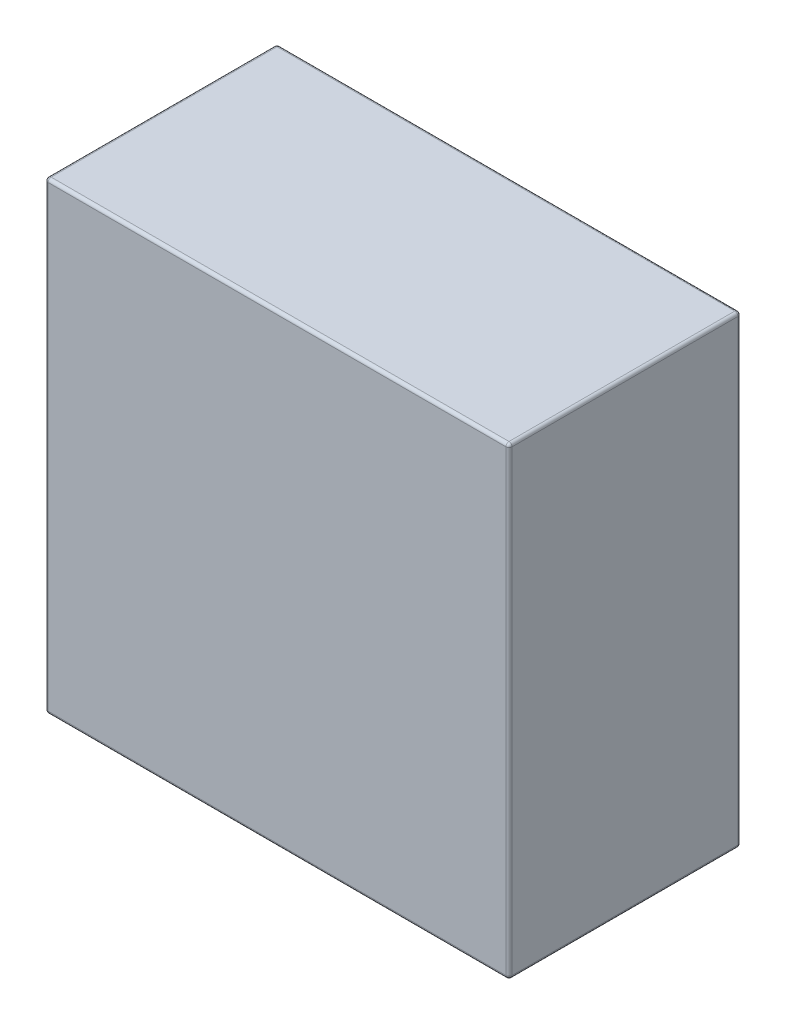
ISO-10303-21;
HEADER;
FILE_DESCRIPTION(('STEP AP214'),'2;1');
FILE_NAME('part.step','',(''),(''),'','','');
FILE_SCHEMA(('AUTOMOTIVE_DESIGN { 1 0 10303 214 1 1 1 1 }'));
ENDSEC;
DATA;
#1=APPLICATION_CONTEXT('core data for automotive mechanical design processes');
#2=APPLICATION_PROTOCOL_DEFINITION('international standard','automotive_design',2000,#1);
#3=PRODUCT_CONTEXT('',#1,'mechanical');
#4=PRODUCT('Part','Part','',(#3));
#5=PRODUCT_RELATED_PRODUCT_CATEGORY('part','',(#4));
#6=PRODUCT_DEFINITION_FORMATION('','',#4);
#7=PRODUCT_DEFINITION_CONTEXT('part definition',#1,'design');
#8=PRODUCT_DEFINITION('design','',#6,#7);
#9=PRODUCT_DEFINITION_SHAPE('','',#8);
#10=(LENGTH_UNIT() NAMED_UNIT(*) SI_UNIT(.MILLI.,.METRE.));
#11=(NAMED_UNIT(*) PLANE_ANGLE_UNIT() SI_UNIT($,.RADIAN.));
#12=(NAMED_UNIT(*) SI_UNIT($,.STERADIAN.) SOLID_ANGLE_UNIT());
#13=UNCERTAINTY_MEASURE_WITH_UNIT(LENGTH_MEASURE(1.E-05),#10,'distance_accuracy_value','');
#14=(GEOMETRIC_REPRESENTATION_CONTEXT(3) GLOBAL_UNCERTAINTY_ASSIGNED_CONTEXT((#13)) GLOBAL_UNIT_ASSIGNED_CONTEXT((#10,
#11,#12)) REPRESENTATION_CONTEXT('',''));
#15=CARTESIAN_POINT('',(0.,0.,0.));
#16=DIRECTION('',(0.,0.,1.));
#17=DIRECTION('',(1.,0.,0.));
#18=AXIS2_PLACEMENT_3D('',#15,#16,#17);
#19=CARTESIAN_POINT('',(0.,0.,150.));
#20=DIRECTION('',(1.,0.,0.));
#21=DIRECTION('',(0.,0.,-1.));
#22=AXIS2_PLACEMENT_3D('',#19,#20,#21);
#23=PLANE('',#22);
#24=DIRECTION('',(0.,0.,-1.));
#25=VECTOR('',#24,1.);
#26=CARTESIAN_POINT('',(0.,298.,150.));
#27=LINE('',#26,#25);
#28=CARTESIAN_POINT('',(0.,298.,148.));
#29=VERTEX_POINT('',#28);
#30=CARTESIAN_POINT('',(0.,298.,2.));
#31=VERTEX_POINT('',#30);
#32=EDGE_CURVE('E125',#29,#31,#27,.T.);
#33=ORIENTED_EDGE('',*,*,#32,.T.);
#34=DIRECTION('',(0.,-1.,0.));
#35=VECTOR('',#34,1.);
#36=CARTESIAN_POINT('',(0.,0.,2.));
#37=LINE('',#36,#35);
#38=CARTESIAN_POINT('',(0.,2.,2.));
#39=VERTEX_POINT('',#38);
#40=EDGE_CURVE('E159',#31,#39,#37,.T.);
#41=ORIENTED_EDGE('',*,*,#40,.T.);
#42=DIRECTION('',(0.,0.,-1.));
#43=VECTOR('',#42,1.);
#44=CARTESIAN_POINT('',(0.,2.,150.));
#45=LINE('',#44,#43);
#46=CARTESIAN_POINT('',(0.,2.,148.));
#47=VERTEX_POINT('',#46);
#48=EDGE_CURVE('E128',#39,#47,#45,.F.);
#49=ORIENTED_EDGE('',*,*,#48,.T.);
#50=DIRECTION('',(0.,-1.,0.));
#51=VECTOR('',#50,1.);
#52=CARTESIAN_POINT('',(0.,0.,148.));
#53=LINE('',#52,#51);
#54=EDGE_CURVE('E121',#47,#29,#53,.F.);
#55=ORIENTED_EDGE('',*,*,#54,.T.);
#56=EDGE_LOOP('',(#33,#41,#49,#55));
#57=FACE_BOUND('',#56,.T.);
#58=ADVANCED_FACE('F34',(#57),#23,.F.);
#59=CARTESIAN_POINT('',(0.,0.,150.));
#60=DIRECTION('',(0.,1.,0.));
#61=DIRECTION('',(0.,0.,1.));
#62=AXIS2_PLACEMENT_3D('',#59,#60,#61);
#63=PLANE('',#62);
#64=DIRECTION('',(0.,0.,-1.));
#65=VECTOR('',#64,1.);
#66=CARTESIAN_POINT('',(2.,0.,150.));
#67=LINE('',#66,#65);
#68=CARTESIAN_POINT('',(2.,0.,148.));
#69=VERTEX_POINT('',#68);
#70=CARTESIAN_POINT('',(2.,0.,2.));
#71=VERTEX_POINT('',#70);
#72=EDGE_CURVE('E190',#69,#71,#67,.T.);
#73=ORIENTED_EDGE('',*,*,#72,.T.);
#74=DIRECTION('',(1.,0.,0.));
#75=VECTOR('',#74,1.);
#76=CARTESIAN_POINT('',(300.,0.,2.));
#77=LINE('',#76,#75);
#78=CARTESIAN_POINT('',(298.,0.,2.));
#79=VERTEX_POINT('',#78);
#80=EDGE_CURVE('E194',#71,#79,#77,.T.);
#81=ORIENTED_EDGE('',*,*,#80,.T.);
#82=DIRECTION('',(0.,0.,-1.));
#83=VECTOR('',#82,1.);
#84=CARTESIAN_POINT('',(298.,0.,150.));
#85=LINE('',#84,#83);
#86=CARTESIAN_POINT('',(298.,0.,148.));
#87=VERTEX_POINT('',#86);
#88=EDGE_CURVE('E192',#79,#87,#85,.F.);
#89=ORIENTED_EDGE('',*,*,#88,.T.);
#90=DIRECTION('',(1.,0.,0.));
#91=VECTOR('',#90,1.);
#92=CARTESIAN_POINT('',(0.,0.,148.));
#93=LINE('',#92,#91);
#94=EDGE_CURVE('E188',#87,#69,#93,.F.);
#95=ORIENTED_EDGE('',*,*,#94,.T.);
#96=EDGE_LOOP('',(#73,#81,#89,#95));
#97=FACE_BOUND('',#96,.T.);
#98=ADVANCED_FACE('F263',(#97),#63,.F.);
#99=CARTESIAN_POINT('',(300.,0.,150.));
#100=DIRECTION('',(-1.,0.,0.));
#101=DIRECTION('',(0.,0.,1.));
#102=AXIS2_PLACEMENT_3D('',#99,#100,#101);
#103=PLANE('',#102);
#104=DIRECTION('',(0.,1.,0.));
#105=VECTOR('',#104,1.);
#106=CARTESIAN_POINT('',(300.,300.,2.));
#107=LINE('',#106,#105);
#108=CARTESIAN_POINT('',(300.,2.,2.));
#109=VERTEX_POINT('',#108);
#110=CARTESIAN_POINT('',(300.,298.,2.));
#111=VERTEX_POINT('',#110);
#112=EDGE_CURVE('E183',#109,#111,#107,.T.);
#113=ORIENTED_EDGE('',*,*,#112,.T.);
#114=DIRECTION('',(0.,0.,-1.));
#115=VECTOR('',#114,1.);
#116=CARTESIAN_POINT('',(300.,298.,150.));
#117=LINE('',#116,#115);
#118=CARTESIAN_POINT('',(300.,298.,148.));
#119=VERTEX_POINT('',#118);
#120=EDGE_CURVE('E185',#111,#119,#117,.F.);
#121=ORIENTED_EDGE('',*,*,#120,.T.);
#122=DIRECTION('',(0.,1.,0.));
#123=VECTOR('',#122,1.);
#124=CARTESIAN_POINT('',(300.,0.,148.));
#125=LINE('',#124,#123);
#126=CARTESIAN_POINT('',(300.,2.,148.));
#127=VERTEX_POINT('',#126);
#128=EDGE_CURVE('E179',#119,#127,#125,.F.);
#129=ORIENTED_EDGE('',*,*,#128,.T.);
#130=DIRECTION('',(0.,0.,-1.));
#131=VECTOR('',#130,1.);
#132=CARTESIAN_POINT('',(300.,2.,150.));
#133=LINE('',#132,#131);
#134=EDGE_CURVE('E181',#127,#109,#133,.T.);
#135=ORIENTED_EDGE('',*,*,#134,.T.);
#136=EDGE_LOOP('',(#113,#121,#129,#135));
#137=FACE_BOUND('',#136,.T.);
#138=ADVANCED_FACE('F272',(#137),#103,.F.);
#139=CARTESIAN_POINT('',(0.,300.,150.));
#140=DIRECTION('',(0.,-1.,0.));
#141=DIRECTION('',(0.,0.,-1.));
#142=AXIS2_PLACEMENT_3D('',#139,#140,#141);
#143=PLANE('',#142);
#144=DIRECTION('',(0.,0.,-1.));
#145=VECTOR('',#144,1.);
#146=CARTESIAN_POINT('',(298.,300.,150.));
#147=LINE('',#146,#145);
#148=CARTESIAN_POINT('',(298.,300.,148.));
#149=VERTEX_POINT('',#148);
#150=CARTESIAN_POINT('',(298.,300.,2.));
#151=VERTEX_POINT('',#150);
#152=EDGE_CURVE('E174',#149,#151,#147,.T.);
#153=ORIENTED_EDGE('',*,*,#152,.T.);
#154=DIRECTION('',(-1.,0.,0.));
#155=VECTOR('',#154,1.);
#156=CARTESIAN_POINT('',(0.,300.,2.));
#157=LINE('',#156,#155);
#158=CARTESIAN_POINT('',(2.,300.,2.));
#159=VERTEX_POINT('',#158);
#160=EDGE_CURVE('E176',#151,#159,#157,.T.);
#161=ORIENTED_EDGE('',*,*,#160,.T.);
#162=DIRECTION('',(0.,0.,-1.));
#163=VECTOR('',#162,1.);
#164=CARTESIAN_POINT('',(2.,300.,150.));
#165=LINE('',#164,#163);
#166=CARTESIAN_POINT('',(2.,300.,148.));
#167=VERTEX_POINT('',#166);
#168=EDGE_CURVE('E170',#159,#167,#165,.F.);
#169=ORIENTED_EDGE('',*,*,#168,.T.);
#170=DIRECTION('',(-1.,0.,0.));
#171=VECTOR('',#170,1.);
#172=CARTESIAN_POINT('',(0.,300.,148.));
#173=LINE('',#172,#171);
#174=EDGE_CURVE('E172',#167,#149,#173,.F.);
#175=ORIENTED_EDGE('',*,*,#174,.T.);
#176=EDGE_LOOP('',(#153,#161,#169,#175));
#177=FACE_BOUND('',#176,.T.);
#178=ADVANCED_FACE('F492',(#177),#143,.F.);
#179=CARTESIAN_POINT('',(0.,0.,150.));
#180=DIRECTION('',(0.,0.,-1.));
#181=DIRECTION('',(-1.,0.,0.));
#182=AXIS2_PLACEMENT_3D('',#179,#180,#181);
#183=PLANE('',#182);
#184=DIRECTION('',(1.,0.,0.));
#185=VECTOR('',#184,1.);
#186=CARTESIAN_POINT('',(0.,2.,150.));
#187=LINE('',#186,#185);
#188=CARTESIAN_POINT('',(2.,2.,150.));
#189=VERTEX_POINT('',#188);
#190=CARTESIAN_POINT('',(298.,2.,150.));
#191=VERTEX_POINT('',#190);
#192=EDGE_CURVE('E43',#189,#191,#187,.T.);
#193=ORIENTED_EDGE('',*,*,#192,.T.);
#194=DIRECTION('',(0.,1.,0.));
#195=VECTOR('',#194,1.);
#196=CARTESIAN_POINT('',(298.,0.,150.));
#197=LINE('',#196,#195);
#198=CARTESIAN_POINT('',(298.,298.,150.));
#199=VERTEX_POINT('',#198);
#200=EDGE_CURVE('E11',#191,#199,#197,.T.);
#201=ORIENTED_EDGE('',*,*,#200,.T.);
#202=DIRECTION('',(-1.,0.,0.));
#203=VECTOR('',#202,1.);
#204=CARTESIAN_POINT('',(0.,298.,150.));
#205=LINE('',#204,#203);
#206=CARTESIAN_POINT('',(2.,298.,150.));
#207=VERTEX_POINT('',#206);
#208=EDGE_CURVE('E197',#199,#207,#205,.T.);
#209=ORIENTED_EDGE('',*,*,#208,.T.);
#210=DIRECTION('',(0.,-1.,0.));
#211=VECTOR('',#210,1.);
#212=CARTESIAN_POINT('',(2.,0.,150.));
#213=LINE('',#212,#211);
#214=EDGE_CURVE('E54',#207,#189,#213,.T.);
#215=ORIENTED_EDGE('',*,*,#214,.T.);
#216=EDGE_LOOP('',(#193,#201,#209,#215));
#217=FACE_BOUND('',#216,.T.);
#218=ADVANCED_FACE('F299',(#217),#183,.F.);
#219=CARTESIAN_POINT('',(0.,0.,0.));
#220=DIRECTION('',(0.,0.,-1.));
#221=DIRECTION('',(-1.,0.,0.));
#222=AXIS2_PLACEMENT_3D('',#219,#220,#221);
#223=PLANE('',#222);
#224=DIRECTION('',(1.,0.,0.));
#225=VECTOR('',#224,1.);
#226=CARTESIAN_POINT('',(0.,2.,0.));
#227=LINE('',#226,#225);
#228=CARTESIAN_POINT('',(298.,2.,0.));
#229=VERTEX_POINT('',#228);
#230=CARTESIAN_POINT('',(2.,2.,0.));
#231=VERTEX_POINT('',#230);
#232=EDGE_CURVE('E161',#229,#231,#227,.F.);
#233=ORIENTED_EDGE('',*,*,#232,.T.);
#234=DIRECTION('',(0.,-1.,0.));
#235=VECTOR('',#234,1.);
#236=CARTESIAN_POINT('',(2.,300.,0.));
#237=LINE('',#236,#235);
#238=CARTESIAN_POINT('',(2.,298.,0.));
#239=VERTEX_POINT('',#238);
#240=EDGE_CURVE('E167',#231,#239,#237,.F.);
#241=ORIENTED_EDGE('',*,*,#240,.T.);
#242=DIRECTION('',(-1.,0.,0.));
#243=VECTOR('',#242,1.);
#244=CARTESIAN_POINT('',(300.,298.,0.));
#245=LINE('',#244,#243);
#246=CARTESIAN_POINT('',(298.,298.,0.));
#247=VERTEX_POINT('',#246);
#248=EDGE_CURVE('E165',#239,#247,#245,.F.);
#249=ORIENTED_EDGE('',*,*,#248,.T.);
#250=DIRECTION('',(0.,1.,0.));
#251=VECTOR('',#250,1.);
#252=CARTESIAN_POINT('',(298.,0.,0.));
#253=LINE('',#252,#251);
#254=EDGE_CURVE('E163',#247,#229,#253,.F.);
#255=ORIENTED_EDGE('',*,*,#254,.T.);
#256=EDGE_LOOP('',(#233,#241,#249,#255));
#257=FACE_BOUND('',#256,.T.);
#258=ADVANCED_FACE('F294',(#257),#223,.T.);
#259=CARTESIAN_POINT('',(298.,0.,148.));
#260=DIRECTION('',(0.,1.,0.));
#261=DIRECTION('',(0.,0.,1.));
#262=AXIS2_PLACEMENT_3D('',#259,#260,#261);
#263=CYLINDRICAL_SURFACE('',#262,2.);
#264=CARTESIAN_POINT('',(298.,298.,148.));
#265=DIRECTION('',(0.,1.,0.));
#266=DIRECTION('',(0.,0.,1.));
#267=AXIS2_PLACEMENT_3D('',#264,#265,#266);
#268=CIRCLE('',#267,2.);
#269=EDGE_CURVE('E38',#199,#119,#268,.T.);
#270=ORIENTED_EDGE('',*,*,#269,.F.);
#271=ORIENTED_EDGE('',*,*,#200,.F.);
#272=CARTESIAN_POINT('',(298.,2.,148.));
#273=DIRECTION('',(0.,-1.,0.));
#274=DIRECTION('',(0.,0.,-1.));
#275=AXIS2_PLACEMENT_3D('',#272,#273,#274);
#276=CIRCLE('',#275,2.);
#277=EDGE_CURVE('E156',#127,#191,#276,.T.);
#278=ORIENTED_EDGE('',*,*,#277,.F.);
#279=ORIENTED_EDGE('',*,*,#128,.F.);
#280=EDGE_LOOP('',(#270,#271,#278,#279));
#281=FACE_BOUND('',#280,.T.);
#282=ADVANCED_FACE('F36',(#281),#263,.T.);
#283=CARTESIAN_POINT('',(298.,298.,148.));
#284=DIRECTION('',(0.,0.,1.));
#285=DIRECTION('',(1.,0.,0.));
#286=AXIS2_PLACEMENT_3D('',#283,#284,#285);
#287=SPHERICAL_SURFACE('',#286,2.);
#288=CARTESIAN_POINT('',(298.,298.,148.));
#289=DIRECTION('',(1.,0.,0.));
#290=DIRECTION('',(0.,0.,-1.));
#291=AXIS2_PLACEMENT_3D('',#288,#289,#290);
#292=CIRCLE('',#291,2.);
#293=EDGE_CURVE('E244',#199,#149,#292,.F.);
#294=ORIENTED_EDGE('',*,*,#293,.F.);
#295=ORIENTED_EDGE('',*,*,#269,.T.);
#296=CARTESIAN_POINT('',(298.,298.,148.));
#297=DIRECTION('',(0.,0.,1.));
#298=DIRECTION('',(1.,0.,0.));
#299=AXIS2_PLACEMENT_3D('',#296,#297,#298);
#300=CIRCLE('',#299,2.);
#301=EDGE_CURVE('E247',#149,#119,#300,.F.);
#302=ORIENTED_EDGE('',*,*,#301,.F.);
#303=EDGE_LOOP('',(#294,#295,#302));
#304=FACE_BOUND('',#303,.T.);
#305=ADVANCED_FACE('F292',(#304),#287,.T.);
#306=CARTESIAN_POINT('',(298.,2.,148.));
#307=DIRECTION('',(0.,0.,1.));
#308=DIRECTION('',(1.,0.,0.));
#309=AXIS2_PLACEMENT_3D('',#306,#307,#308);
#310=SPHERICAL_SURFACE('',#309,2.);
#311=CARTESIAN_POINT('',(298.,2.,148.));
#312=DIRECTION('',(0.,0.,1.));
#313=DIRECTION('',(1.,0.,0.));
#314=AXIS2_PLACEMENT_3D('',#311,#312,#313);
#315=CIRCLE('',#314,2.);
#316=EDGE_CURVE('E238',#127,#87,#315,.F.);
#317=ORIENTED_EDGE('',*,*,#316,.F.);
#318=ORIENTED_EDGE('',*,*,#277,.T.);
#319=CARTESIAN_POINT('',(298.,2.,148.));
#320=DIRECTION('',(1.,0.,0.));
#321=DIRECTION('',(0.,0.,-1.));
#322=AXIS2_PLACEMENT_3D('',#319,#320,#321);
#323=CIRCLE('',#322,2.);
#324=EDGE_CURVE('E241',#87,#191,#323,.F.);
#325=ORIENTED_EDGE('',*,*,#324,.F.);
#326=EDGE_LOOP('',(#317,#318,#325));
#327=FACE_BOUND('',#326,.T.);
#328=ADVANCED_FACE('F253',(#327),#310,.T.);
#329=CARTESIAN_POINT('',(298.,298.,150.));
#330=DIRECTION('',(0.,0.,-1.));
#331=DIRECTION('',(-1.,0.,0.));
#332=AXIS2_PLACEMENT_3D('',#329,#330,#331);
#333=CYLINDRICAL_SURFACE('',#332,2.);
#334=ORIENTED_EDGE('',*,*,#301,.T.);
#335=ORIENTED_EDGE('',*,*,#120,.F.);
#336=CARTESIAN_POINT('',(298.,298.,2.));
#337=DIRECTION('',(0.,0.,-1.));
#338=DIRECTION('',(-1.,0.,0.));
#339=AXIS2_PLACEMENT_3D('',#336,#337,#338);
#340=CIRCLE('',#339,2.);
#341=EDGE_CURVE('E232',#151,#111,#340,.T.);
#342=ORIENTED_EDGE('',*,*,#341,.F.);
#343=ORIENTED_EDGE('',*,*,#152,.F.);
#344=EDGE_LOOP('',(#334,#335,#342,#343));
#345=FACE_BOUND('',#344,.T.);
#346=ADVANCED_FACE('F287',(#345),#333,.T.);
#347=CARTESIAN_POINT('',(0.,298.,148.));
#348=DIRECTION('',(-1.,0.,0.));
#349=DIRECTION('',(0.,0.,1.));
#350=AXIS2_PLACEMENT_3D('',#347,#348,#349);
#351=CYLINDRICAL_SURFACE('',#350,2.);
#352=ORIENTED_EDGE('',*,*,#293,.T.);
#353=ORIENTED_EDGE('',*,*,#174,.F.);
#354=CARTESIAN_POINT('',(2.,298.,148.));
#355=DIRECTION('',(-1.,0.,0.));
#356=DIRECTION('',(0.,0.,1.));
#357=AXIS2_PLACEMENT_3D('',#354,#355,#356);
#358=CIRCLE('',#357,2.);
#359=EDGE_CURVE('E140',#207,#167,#358,.T.);
#360=ORIENTED_EDGE('',*,*,#359,.F.);
#361=ORIENTED_EDGE('',*,*,#208,.F.);
#362=EDGE_LOOP('',(#352,#353,#360,#361));
#363=FACE_BOUND('',#362,.T.);
#364=ADVANCED_FACE('F356',(#363),#351,.T.);
#365=CARTESIAN_POINT('',(2.,0.,148.));
#366=DIRECTION('',(0.,-1.,0.));
#367=DIRECTION('',(0.,0.,-1.));
#368=AXIS2_PLACEMENT_3D('',#365,#366,#367);
#369=CYLINDRICAL_SURFACE('',#368,2.);
#370=CARTESIAN_POINT('',(2.,2.,148.));
#371=DIRECTION('',(0.,-1.,0.));
#372=DIRECTION('',(0.,0.,-1.));
#373=AXIS2_PLACEMENT_3D('',#370,#371,#372);
#374=CIRCLE('',#373,2.);
#375=EDGE_CURVE('E141',#189,#47,#374,.T.);
#376=ORIENTED_EDGE('',*,*,#375,.F.);
#377=ORIENTED_EDGE('',*,*,#214,.F.);
#378=CARTESIAN_POINT('',(2.,298.,148.));
#379=DIRECTION('',(0.,1.,0.));
#380=DIRECTION('',(0.,0.,1.));
#381=AXIS2_PLACEMENT_3D('',#378,#379,#380);
#382=CIRCLE('',#381,2.);
#383=EDGE_CURVE('E134',#29,#207,#382,.T.);
#384=ORIENTED_EDGE('',*,*,#383,.F.);
#385=ORIENTED_EDGE('',*,*,#54,.F.);
#386=EDGE_LOOP('',(#376,#377,#384,#385));
#387=FACE_BOUND('',#386,.T.);
#388=ADVANCED_FACE('F136',(#387),#369,.T.);
#389=CARTESIAN_POINT('',(0.,2.,148.));
#390=DIRECTION('',(1.,0.,0.));
#391=DIRECTION('',(0.,0.,-1.));
#392=AXIS2_PLACEMENT_3D('',#389,#390,#391);
#393=CYLINDRICAL_SURFACE('',#392,2.);
#394=ORIENTED_EDGE('',*,*,#324,.T.);
#395=ORIENTED_EDGE('',*,*,#192,.F.);
#396=CARTESIAN_POINT('',(2.,2.,148.));
#397=DIRECTION('',(-1.,0.,0.));
#398=DIRECTION('',(0.,0.,1.));
#399=AXIS2_PLACEMENT_3D('',#396,#397,#398);
#400=CIRCLE('',#399,2.);
#401=EDGE_CURVE('E227',#69,#189,#400,.T.);
#402=ORIENTED_EDGE('',*,*,#401,.F.);
#403=ORIENTED_EDGE('',*,*,#94,.F.);
#404=EDGE_LOOP('',(#394,#395,#402,#403));
#405=FACE_BOUND('',#404,.T.);
#406=ADVANCED_FACE('F259',(#405),#393,.T.);
#407=CARTESIAN_POINT('',(298.,2.,150.));
#408=DIRECTION('',(0.,0.,-1.));
#409=DIRECTION('',(-1.,0.,0.));
#410=AXIS2_PLACEMENT_3D('',#407,#408,#409);
#411=CYLINDRICAL_SURFACE('',#410,2.);
#412=ORIENTED_EDGE('',*,*,#316,.T.);
#413=ORIENTED_EDGE('',*,*,#88,.F.);
#414=CARTESIAN_POINT('',(298.,2.,2.));
#415=DIRECTION('',(0.,0.,-1.));
#416=DIRECTION('',(-1.,0.,0.));
#417=AXIS2_PLACEMENT_3D('',#414,#415,#416);
#418=CIRCLE('',#417,2.);
#419=EDGE_CURVE('E224',#109,#79,#418,.T.);
#420=ORIENTED_EDGE('',*,*,#419,.F.);
#421=ORIENTED_EDGE('',*,*,#134,.F.);
#422=EDGE_LOOP('',(#412,#413,#420,#421));
#423=FACE_BOUND('',#422,.T.);
#424=ADVANCED_FACE('F269',(#423),#411,.T.);
#425=CARTESIAN_POINT('',(298.,0.,2.));
#426=DIRECTION('',(0.,-1.,0.));
#427=DIRECTION('',(0.,0.,-1.));
#428=AXIS2_PLACEMENT_3D('',#425,#426,#427);
#429=CYLINDRICAL_SURFACE('',#428,2.);
#430=CARTESIAN_POINT('',(298.,298.,2.));
#431=DIRECTION('',(0.,1.,0.));
#432=DIRECTION('',(0.,0.,1.));
#433=AXIS2_PLACEMENT_3D('',#430,#431,#432);
#434=CIRCLE('',#433,2.);
#435=EDGE_CURVE('E235',#111,#247,#434,.T.);
#436=ORIENTED_EDGE('',*,*,#435,.F.);
#437=ORIENTED_EDGE('',*,*,#112,.F.);
#438=CARTESIAN_POINT('',(298.,2.,2.));
#439=DIRECTION('',(0.,-1.,0.));
#440=DIRECTION('',(0.,0.,-1.));
#441=AXIS2_PLACEMENT_3D('',#438,#439,#440);
#442=CIRCLE('',#441,2.);
#443=EDGE_CURVE('E221',#229,#109,#442,.T.);
#444=ORIENTED_EDGE('',*,*,#443,.F.);
#445=ORIENTED_EDGE('',*,*,#254,.F.);
#446=EDGE_LOOP('',(#436,#437,#444,#445));
#447=FACE_BOUND('',#446,.T.);
#448=ADVANCED_FACE('F277',(#447),#429,.T.);
#449=CARTESIAN_POINT('',(298.,298.,2.));
#450=DIRECTION('',(0.,0.,1.));
#451=DIRECTION('',(1.,0.,0.));
#452=AXIS2_PLACEMENT_3D('',#449,#450,#451);
#453=SPHERICAL_SURFACE('',#452,2.);
#454=ORIENTED_EDGE('',*,*,#341,.T.);
#455=ORIENTED_EDGE('',*,*,#435,.T.);
#456=CARTESIAN_POINT('',(298.,298.,2.));
#457=DIRECTION('',(1.,0.,0.));
#458=DIRECTION('',(0.,0.,-1.));
#459=AXIS2_PLACEMENT_3D('',#456,#457,#458);
#460=CIRCLE('',#459,2.);
#461=EDGE_CURVE('E148',#151,#247,#460,.F.);
#462=ORIENTED_EDGE('',*,*,#461,.F.);
#463=EDGE_LOOP('',(#454,#455,#462));
#464=FACE_BOUND('',#463,.T.);
#465=ADVANCED_FACE('F283',(#464),#453,.T.);
#466=CARTESIAN_POINT('',(2.,298.,148.));
#467=DIRECTION('',(0.,0.,1.));
#468=DIRECTION('',(1.,0.,0.));
#469=AXIS2_PLACEMENT_3D('',#466,#467,#468);
#470=SPHERICAL_SURFACE('',#469,2.);
#471=ORIENTED_EDGE('',*,*,#383,.T.);
#472=ORIENTED_EDGE('',*,*,#359,.T.);
#473=CARTESIAN_POINT('',(2.,298.,148.));
#474=DIRECTION('',(0.,0.,1.));
#475=DIRECTION('',(1.,0.,0.));
#476=AXIS2_PLACEMENT_3D('',#473,#474,#475);
#477=CIRCLE('',#476,2.);
#478=EDGE_CURVE('E144',#29,#167,#477,.F.);
#479=ORIENTED_EDGE('',*,*,#478,.F.);
#480=EDGE_LOOP('',(#471,#472,#479));
#481=FACE_BOUND('',#480,.T.);
#482=ADVANCED_FACE('F145',(#481),#470,.T.);
#483=CARTESIAN_POINT('',(2.,2.,148.));
#484=DIRECTION('',(0.,0.,1.));
#485=DIRECTION('',(1.,0.,0.));
#486=AXIS2_PLACEMENT_3D('',#483,#484,#485);
#487=SPHERICAL_SURFACE('',#486,2.);
#488=ORIENTED_EDGE('',*,*,#401,.T.);
#489=ORIENTED_EDGE('',*,*,#375,.T.);
#490=CARTESIAN_POINT('',(2.,2.,148.));
#491=DIRECTION('',(0.,0.,1.));
#492=DIRECTION('',(1.,0.,0.));
#493=AXIS2_PLACEMENT_3D('',#490,#491,#492);
#494=CIRCLE('',#493,2.);
#495=EDGE_CURVE('E149',#69,#47,#494,.F.);
#496=ORIENTED_EDGE('',*,*,#495,.F.);
#497=EDGE_LOOP('',(#488,#489,#496));
#498=FACE_BOUND('',#497,.T.);
#499=ADVANCED_FACE('F339',(#498),#487,.T.);
#500=CARTESIAN_POINT('',(298.,2.,2.));
#501=DIRECTION('',(0.,0.,1.));
#502=DIRECTION('',(1.,0.,0.));
#503=AXIS2_PLACEMENT_3D('',#500,#501,#502);
#504=SPHERICAL_SURFACE('',#503,2.);
#505=ORIENTED_EDGE('',*,*,#443,.T.);
#506=ORIENTED_EDGE('',*,*,#419,.T.);
#507=CARTESIAN_POINT('',(298.,2.,2.));
#508=DIRECTION('',(1.,0.,0.));
#509=DIRECTION('',(0.,0.,-1.));
#510=AXIS2_PLACEMENT_3D('',#507,#508,#509);
#511=CIRCLE('',#510,2.);
#512=EDGE_CURVE('E215',#229,#79,#511,.F.);
#513=ORIENTED_EDGE('',*,*,#512,.F.);
#514=EDGE_LOOP('',(#505,#506,#513));
#515=FACE_BOUND('',#514,.T.);
#516=ADVANCED_FACE('F335',(#515),#504,.T.);
#517=CARTESIAN_POINT('',(0.,298.,2.));
#518=DIRECTION('',(1.,0.,0.));
#519=DIRECTION('',(0.,0.,-1.));
#520=AXIS2_PLACEMENT_3D('',#517,#518,#519);
#521=CYLINDRICAL_SURFACE('',#520,2.);
#522=ORIENTED_EDGE('',*,*,#461,.T.);
#523=ORIENTED_EDGE('',*,*,#248,.F.);
#524=CARTESIAN_POINT('',(2.,298.,2.));
#525=DIRECTION('',(-1.,0.,0.));
#526=DIRECTION('',(0.,0.,1.));
#527=AXIS2_PLACEMENT_3D('',#524,#525,#526);
#528=CIRCLE('',#527,2.);
#529=EDGE_CURVE('E212',#159,#239,#528,.T.);
#530=ORIENTED_EDGE('',*,*,#529,.F.);
#531=ORIENTED_EDGE('',*,*,#160,.F.);
#532=EDGE_LOOP('',(#522,#523,#530,#531));
#533=FACE_BOUND('',#532,.T.);
#534=ADVANCED_FACE('F332',(#533),#521,.T.);
#535=CARTESIAN_POINT('',(2.,298.,150.));
#536=DIRECTION('',(0.,0.,-1.));
#537=DIRECTION('',(-1.,0.,0.));
#538=AXIS2_PLACEMENT_3D('',#535,#536,#537);
#539=CYLINDRICAL_SURFACE('',#538,2.);
#540=ORIENTED_EDGE('',*,*,#478,.T.);
#541=ORIENTED_EDGE('',*,*,#168,.F.);
#542=CARTESIAN_POINT('',(2.,298.,2.));
#543=DIRECTION('',(0.,0.,-1.));
#544=DIRECTION('',(-1.,0.,0.));
#545=AXIS2_PLACEMENT_3D('',#542,#543,#544);
#546=CIRCLE('',#545,2.);
#547=EDGE_CURVE('E152',#31,#159,#546,.T.);
#548=ORIENTED_EDGE('',*,*,#547,.F.);
#549=ORIENTED_EDGE('',*,*,#32,.F.);
#550=EDGE_LOOP('',(#540,#541,#548,#549));
#551=FACE_BOUND('',#550,.T.);
#552=ADVANCED_FACE('F151',(#551),#539,.T.);
#553=CARTESIAN_POINT('',(2.,2.,150.));
#554=DIRECTION('',(0.,0.,-1.));
#555=DIRECTION('',(-1.,0.,0.));
#556=AXIS2_PLACEMENT_3D('',#553,#554,#555);
#557=CYLINDRICAL_SURFACE('',#556,2.);
#558=ORIENTED_EDGE('',*,*,#495,.T.);
#559=ORIENTED_EDGE('',*,*,#48,.F.);
#560=CARTESIAN_POINT('',(2.,2.,2.));
#561=DIRECTION('',(0.,0.,-1.));
#562=DIRECTION('',(-1.,0.,0.));
#563=AXIS2_PLACEMENT_3D('',#560,#561,#562);
#564=CIRCLE('',#563,2.);
#565=EDGE_CURVE('E208',#71,#39,#564,.T.);
#566=ORIENTED_EDGE('',*,*,#565,.F.);
#567=ORIENTED_EDGE('',*,*,#72,.F.);
#568=EDGE_LOOP('',(#558,#559,#566,#567));
#569=FACE_BOUND('',#568,.T.);
#570=ADVANCED_FACE('F325',(#569),#557,.T.);
#571=CARTESIAN_POINT('',(0.,2.,2.));
#572=DIRECTION('',(-1.,0.,0.));
#573=DIRECTION('',(0.,0.,1.));
#574=AXIS2_PLACEMENT_3D('',#571,#572,#573);
#575=CYLINDRICAL_SURFACE('',#574,2.);
#576=ORIENTED_EDGE('',*,*,#512,.T.);
#577=ORIENTED_EDGE('',*,*,#80,.F.);
#578=CARTESIAN_POINT('',(2.,2.,2.));
#579=DIRECTION('',(-1.,0.,0.));
#580=DIRECTION('',(0.,0.,1.));
#581=AXIS2_PLACEMENT_3D('',#578,#579,#580);
#582=CIRCLE('',#581,2.);
#583=EDGE_CURVE('E205',#231,#71,#582,.T.);
#584=ORIENTED_EDGE('',*,*,#583,.F.);
#585=ORIENTED_EDGE('',*,*,#232,.F.);
#586=EDGE_LOOP('',(#576,#577,#584,#585));
#587=FACE_BOUND('',#586,.T.);
#588=ADVANCED_FACE('F321',(#587),#575,.T.);
#589=CARTESIAN_POINT('',(2.,298.,2.));
#590=DIRECTION('',(0.,0.,1.));
#591=DIRECTION('',(1.,0.,0.));
#592=AXIS2_PLACEMENT_3D('',#589,#590,#591);
#593=SPHERICAL_SURFACE('',#592,2.);
#594=ORIENTED_EDGE('',*,*,#547,.T.);
#595=ORIENTED_EDGE('',*,*,#529,.T.);
#596=CARTESIAN_POINT('',(2.,298.,2.));
#597=DIRECTION('',(0.,1.,0.));
#598=DIRECTION('',(0.,0.,1.));
#599=AXIS2_PLACEMENT_3D('',#596,#597,#598);
#600=CIRCLE('',#599,2.);
#601=EDGE_CURVE('E203',#31,#239,#600,.F.);
#602=ORIENTED_EDGE('',*,*,#601,.F.);
#603=EDGE_LOOP('',(#594,#595,#602));
#604=FACE_BOUND('',#603,.T.);
#605=ADVANCED_FACE('F317',(#604),#593,.T.);
#606=CARTESIAN_POINT('',(2.,2.,2.));
#607=DIRECTION('',(0.,0.,1.));
#608=DIRECTION('',(1.,0.,0.));
#609=AXIS2_PLACEMENT_3D('',#606,#607,#608);
#610=SPHERICAL_SURFACE('',#609,2.);
#611=ORIENTED_EDGE('',*,*,#583,.T.);
#612=ORIENTED_EDGE('',*,*,#565,.T.);
#613=CARTESIAN_POINT('',(2.,2.,2.));
#614=DIRECTION('',(0.,-1.,0.));
#615=DIRECTION('',(0.,0.,-1.));
#616=AXIS2_PLACEMENT_3D('',#613,#614,#615);
#617=CIRCLE('',#616,2.);
#618=EDGE_CURVE('E201',#231,#39,#617,.F.);
#619=ORIENTED_EDGE('',*,*,#618,.F.);
#620=EDGE_LOOP('',(#611,#612,#619));
#621=FACE_BOUND('',#620,.T.);
#622=ADVANCED_FACE('F313',(#621),#610,.T.);
#623=CARTESIAN_POINT('',(2.,0.,2.));
#624=DIRECTION('',(0.,1.,0.));
#625=DIRECTION('',(0.,0.,1.));
#626=AXIS2_PLACEMENT_3D('',#623,#624,#625);
#627=CYLINDRICAL_SURFACE('',#626,2.);
#628=ORIENTED_EDGE('',*,*,#601,.T.);
#629=ORIENTED_EDGE('',*,*,#240,.F.);
#630=ORIENTED_EDGE('',*,*,#618,.T.);
#631=ORIENTED_EDGE('',*,*,#40,.F.);
#632=EDGE_LOOP('',(#628,#629,#630,#631));
#633=FACE_BOUND('',#632,.T.);
#634=ADVANCED_FACE('F310',(#633),#627,.T.);
#635=CLOSED_SHELL('',(#58,#98,#138,#178,#218,#258,#282,#305,#328,#346,#364,#388,#406,#424,#448,
#465,#482,#499,#516,#534,#552,#570,#588,#605,#622,#634));
#636=MANIFOLD_SOLID_BREP('B2',#635);
#637=ADVANCED_BREP_SHAPE_REPRESENTATION('',(#18,#636),#14);
#638=SHAPE_DEFINITION_REPRESENTATION(#9,#637);
ENDSEC;
END-ISO-10303-21;
